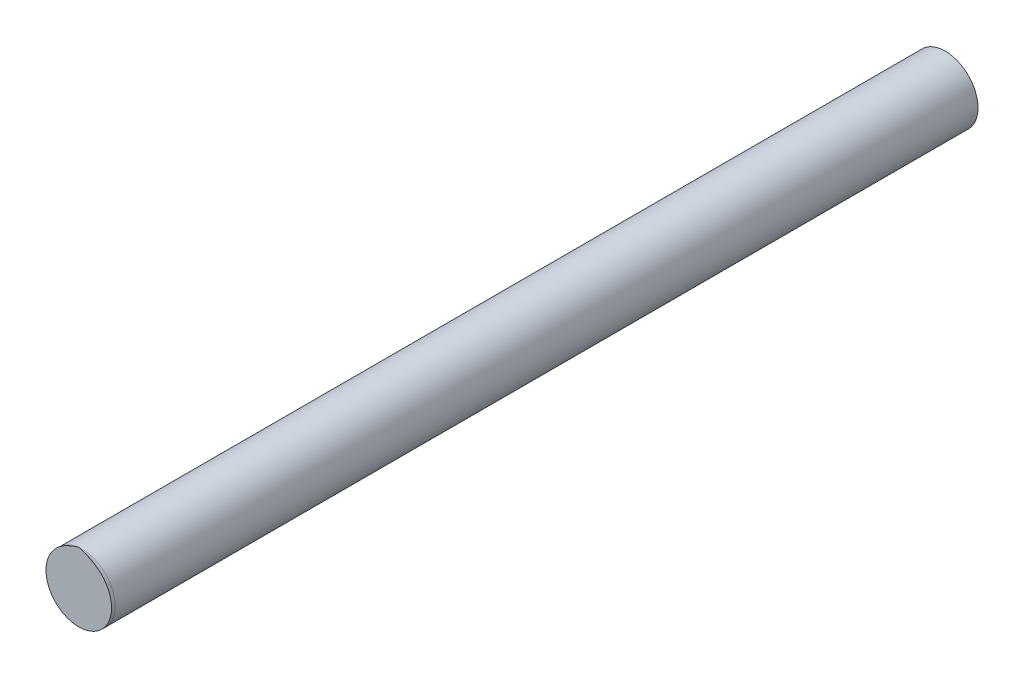
ISO-10303-21;
HEADER;
FILE_DESCRIPTION(('STEP AP214'),'2;1');
FILE_NAME('part.step','',(''),(''),'','','');
FILE_SCHEMA(('AUTOMOTIVE_DESIGN { 1 0 10303 214 1 1 1 1 }'));
ENDSEC;
DATA;
#1=APPLICATION_CONTEXT('core data for automotive mechanical design processes');
#2=APPLICATION_PROTOCOL_DEFINITION('international standard','automotive_design',2000,#1);
#3=PRODUCT_CONTEXT('',#1,'mechanical');
#4=PRODUCT('Part','Part','',(#3));
#5=PRODUCT_RELATED_PRODUCT_CATEGORY('part','',(#4));
#6=PRODUCT_DEFINITION_FORMATION('','',#4);
#7=PRODUCT_DEFINITION_CONTEXT('part definition',#1,'design');
#8=PRODUCT_DEFINITION('design','',#6,#7);
#9=PRODUCT_DEFINITION_SHAPE('','',#8);
#10=(LENGTH_UNIT() NAMED_UNIT(*) SI_UNIT(.MILLI.,.METRE.));
#11=(NAMED_UNIT(*) PLANE_ANGLE_UNIT() SI_UNIT($,.RADIAN.));
#12=(NAMED_UNIT(*) SI_UNIT($,.STERADIAN.) SOLID_ANGLE_UNIT());
#13=UNCERTAINTY_MEASURE_WITH_UNIT(LENGTH_MEASURE(1.E-05),#10,'distance_accuracy_value','');
#14=(GEOMETRIC_REPRESENTATION_CONTEXT(3) GLOBAL_UNCERTAINTY_ASSIGNED_CONTEXT((#13)) GLOBAL_UNIT_ASSIGNED_CONTEXT((#10,
#11,#12)) REPRESENTATION_CONTEXT('',''));
#15=CARTESIAN_POINT('',(0.,0.,0.));
#16=DIRECTION('',(0.,0.,1.));
#17=DIRECTION('',(1.,0.,0.));
#18=AXIS2_PLACEMENT_3D('',#15,#16,#17);
#19=CARTESIAN_POINT('',(0.0127,-2.2352,-7.3152));
#20=DIRECTION('',(0.,0.,-1.));
#21=DIRECTION('',(-1.,0.,0.));
#22=AXIS2_PLACEMENT_3D('',#19,#20,#21);
#23=PLANE('',#22);
#24=CARTESIAN_POINT('',(0.0127,-2.2352,-7.3152));
#25=DIRECTION('',(0.,0.,1.));
#26=DIRECTION('',(0.,1.,0.));
#27=AXIS2_PLACEMENT_3D('',#24,#25,#26);
#28=CIRCLE('',#27,0.2286);
#29=CARTESIAN_POINT('',(0.0127,-2.0066,-7.3152));
#30=VERTEX_POINT('',#29);
#31=EDGE_CURVE('E11',#30,#30,#28,.T.);
#32=ORIENTED_EDGE('',*,*,#31,.F.);
#33=EDGE_LOOP('',(#32));
#34=FACE_BOUND('',#33,.T.);
#35=ADVANCED_FACE('F16',(#34),#23,.T.);
#36=CARTESIAN_POINT('',(0.0127,-2.2352,-1.175004));
#37=DIRECTION('',(0.,0.,1.));
#38=DIRECTION('',(1.,0.,0.));
#39=AXIS2_PLACEMENT_3D('',#36,#37,#38);
#40=CYLINDRICAL_SURFACE('',#39,0.2286);
#41=CARTESIAN_POINT('',(0.0127,-2.2352,-1.2954));
#42=DIRECTION('',(0.,0.,1.));
#43=DIRECTION('',(0.,-1.,0.));
#44=AXIS2_PLACEMENT_3D('',#41,#42,#43);
#45=CIRCLE('',#44,0.2286);
#46=CARTESIAN_POINT('',(0.0127,-2.4638,-1.2954));
#47=VERTEX_POINT('',#46);
#48=EDGE_CURVE('E38',#47,#47,#45,.T.);
#49=ORIENTED_EDGE('',*,*,#48,.F.);
#50=EDGE_LOOP('',(#49));
#51=FACE_BOUND('',#50,.T.);
#52=ORIENTED_EDGE('',*,*,#31,.T.);
#53=EDGE_LOOP('',(#52));
#54=FACE_BOUND('',#53,.T.);
#55=ADVANCED_FACE('F50',(#51,#54),#40,.T.);
#56=CARTESIAN_POINT('',(0.0127007321094578,-2.22216555770495,-1.27));
#57=DIRECTION('',(0.,0.,1.));
#58=DIRECTION('',(1.,0.,0.));
#59=AXIS2_PLACEMENT_3D('',#56,#57,#58);
#60=PLANE('',#59);
#61=CARTESIAN_POINT('',(0.0127,-1.9812,-1.27));
#62=CARTESIAN_POINT('',(0.00268453589315014,-1.98453848803574,-1.27));
#63=CARTESIAN_POINT('',(-0.0162866236035965,-1.99088808571777,-1.27));
#64=CARTESIAN_POINT('',(-0.0410183642985658,-2.00010544064091,-1.27));
#65=CARTESIAN_POINT('',(-0.0628260454743532,-2.00952859681412,-1.27));
#66=CARTESIAN_POINT('',(-0.0822967720433124,-2.01937510670831,-1.27));
#67=CARTESIAN_POINT('',(-0.100120348057278,-2.02990548522079,-1.27));
#68=CARTESIAN_POINT('',(-0.116781937251762,-2.04137724442835,-1.27));
#69=CARTESIAN_POINT('',(-0.132839108016757,-2.0542710498886,-1.27));
#70=CARTESIAN_POINT('',(-0.148727420944944,-2.06927436297462,-1.27));
#71=CARTESIAN_POINT('',(-0.164657633850317,-2.08728470245323,-1.27));
#72=CARTESIAN_POINT('',(-0.180074245920841,-2.10888467021943,-1.27));
#73=CARTESIAN_POINT('',(-0.193409834516667,-2.13296199528795,-1.27));
#74=CARTESIAN_POINT('',(-0.20399202444907,-2.15885823902901,-1.27));
#75=CARTESIAN_POINT('',(-0.21135486840735,-2.18559786433274,-1.27));
#76=CARTESIAN_POINT('',(-0.215475021750085,-2.21281721006514,-1.27));
#77=CARTESIAN_POINT('',(-0.216357590024493,-2.24013488917084,-1.27));
#78=CARTESIAN_POINT('',(-0.213992962384416,-2.26747947960423,-1.27));
#79=CARTESIAN_POINT('',(-0.208443621429957,-2.2941736482257,-1.27));
#80=CARTESIAN_POINT('',(-0.199750601001047,-2.32009454117527,-1.27));
#81=CARTESIAN_POINT('',(-0.188110652602123,-2.34467419291224,-1.27));
#82=CARTESIAN_POINT('',(-0.17359153704661,-2.36778266122302,-1.27));
#83=CARTESIAN_POINT('',(-0.156513452433226,-2.38891157332503,-1.27));
#84=CARTESIAN_POINT('',(-0.13699193671822,-2.40792825804267,-1.27));
#85=CARTESIAN_POINT('',(-0.115432337377993,-2.42443574353411,-1.27));
#86=CARTESIAN_POINT('',(-0.0920081457145064,-2.43830942531348,-1.27));
#87=CARTESIAN_POINT('',(-0.067168246100247,-2.44927753579124,-1.27));
#88=CARTESIAN_POINT('',(-0.0411654466827596,-2.45724046701267,-1.27));
#89=CARTESIAN_POINT('',(-0.0144106131406973,-2.46205434577351,-1.27));
#90=CARTESIAN_POINT('',(0.00361434144617438,-2.46313111540965,-1.27));
#91=CARTESIAN_POINT('',(0.0127,-2.46313111540965,-1.27));
#92=B_SPLINE_CURVE_WITH_KNOTS('',3,(#61,#62,#63,#64,#65,#66,#67,#68,#69,#70,#71,#72,#73,#74,#75,
#76,#77,#78,#79,#80,#81,#82,#83,#84,#85,#86,#87,#88,#89,#90,#91),.UNSPECIFIED.,.F.,.F.,(4,1,1,1,
1,1,1,1,1,1,1,1,1,1,1,1,1,1,1,1,1,1,1,1,1,1,1,1,4),(0.,0.03571428571429,0.07142857142857,
0.1071428571429,0.1428571428571,0.1785714285714,0.2142857142857,0.25,0.2857142857143,
0.3214285714286,0.3571428571429,0.3928571428571,0.4285714285714,0.4642857142857,0.5,
0.5357142857143,0.5714285714286,0.6071428571429,0.6428571428571,0.6785714285714,0.7142857142857,
0.75,0.7857142857143,0.8214285714286,0.8571428571429,0.8928571428571,0.9285714285714,
0.9642857142857,1.),.UNSPECIFIED.);
#93=CARTESIAN_POINT('',(0.0127,-1.9812,-1.27));
#94=VERTEX_POINT('',#93);
#95=CARTESIAN_POINT('',(0.0127,-2.46313111540965,-1.27));
#96=VERTEX_POINT('',#95);
#97=EDGE_CURVE('E29',#94,#96,#92,.T.);
#98=ORIENTED_EDGE('',*,*,#97,.T.);
#99=CARTESIAN_POINT('',(0.0127,-1.9812,-1.27));
#100=CARTESIAN_POINT('',(0.0228227855411093,-1.98457426184709,-1.27));
#101=CARTESIAN_POINT('',(0.0419732407383392,-1.99098489890362,-1.27));
#102=CARTESIAN_POINT('',(0.0668594976546514,-2.00027912066515,-1.27));
#103=CARTESIAN_POINT('',(0.088718251439825,-2.00975716922642,-1.27));
#104=CARTESIAN_POINT('',(0.108185495115445,-2.01964304198981,-1.27));
#105=CARTESIAN_POINT('',(0.125897486815877,-2.03015124521873,-1.27));
#106=CARTESIAN_POINT('',(0.14237132454779,-2.04152383144074,-1.27));
#107=CARTESIAN_POINT('',(0.158301038449385,-2.05433092471322,-1.27));
#108=CARTESIAN_POINT('',(0.174148102948894,-2.06928822834186,-1.27));
#109=CARTESIAN_POINT('',(0.190215050040158,-2.08748289030806,-1.27));
#110=CARTESIAN_POINT('',(0.205476916571659,-2.10890311435856,-1.27));
#111=CARTESIAN_POINT('',(0.218845003461188,-2.13301324644224,-1.27));
#112=CARTESIAN_POINT('',(0.2295035238946,-2.15916734320583,-1.27));
#113=CARTESIAN_POINT('',(0.236813676595601,-2.1858981076558,-1.27));
#114=CARTESIAN_POINT('',(0.240891682964108,-2.21301932205436,-1.27));
#115=CARTESIAN_POINT('',(0.241752080196955,-2.24034241673801,-1.27));
#116=CARTESIAN_POINT('',(0.239364910654896,-2.26766884265858,-1.27));
#117=CARTESIAN_POINT('',(0.233791695911203,-2.29436209366719,-1.27));
#118=CARTESIAN_POINT('',(0.225092007512316,-2.32023779240718,-1.27));
#119=CARTESIAN_POINT('',(0.213434625043231,-2.34481129696137,-1.27));
#120=CARTESIAN_POINT('',(0.198921412840046,-2.367879735307,-1.27));
#121=CARTESIAN_POINT('',(0.181828505387093,-2.38900368860511,-1.27));
#122=CARTESIAN_POINT('',(0.16232731027808,-2.40798311839751,-1.27));
#123=CARTESIAN_POINT('',(0.140758068646647,-2.42448516383151,-1.27));
#124=CARTESIAN_POINT('',(0.117362136111606,-2.43833220271649,-1.27));
#125=CARTESIAN_POINT('',(0.0925176233562552,-2.44929593096908,-1.27));
#126=CARTESIAN_POINT('',(0.0665430303986108,-2.45724496480707,-1.27));
#127=CARTESIAN_POINT('',(0.0397926285827066,-2.4620562840757,-1.27));
#128=CARTESIAN_POINT('',(0.021779552573048,-2.46313111540965,-1.27));
#129=CARTESIAN_POINT('',(0.0127,-2.46313111540965,-1.27));
#130=B_SPLINE_CURVE_WITH_KNOTS('',3,(#99,#100,#101,#102,#103,#104,#105,#106,#107,#108,#109,#110,
#111,#112,#113,#114,#115,#116,#117,#118,#119,#120,#121,#122,#123,#124,#125,#126,#127,#128,#129),
.UNSPECIFIED.,.F.,.F.,(4,1,1,1,1,1,1,1,1,1,1,1,1,1,1,1,1,1,1,1,1,1,1,1,1,1,1,1,4),(0.,
0.03571428571429,0.07142857142857,0.1071428571429,0.1428571428571,0.1785714285714,
0.2142857142857,0.25,0.2857142857143,0.3214285714286,0.3571428571429,0.3928571428571,
0.4285714285714,0.4642857142857,0.5,0.5357142857143,0.5714285714286,0.6071428571429,
0.6428571428571,0.6785714285714,0.7142857142857,0.75,0.7857142857143,0.8214285714286,
0.8571428571429,0.8928571428571,0.9285714285714,0.9642857142857,1.),.UNSPECIFIED.);
#131=EDGE_CURVE('E21',#94,#96,#130,.T.);
#132=ORIENTED_EDGE('',*,*,#131,.F.);
#133=EDGE_LOOP('',(#98,#132));
#134=FACE_BOUND('',#133,.T.);
#135=ADVANCED_FACE('F37',(#134),#60,.T.);
#136=CARTESIAN_POINT('',(0.0127,-1.9812,-1.2954));
#137=DIRECTION('',(1.,0.,0.));
#138=DIRECTION('',(0.,0.,-1.));
#139=AXIS2_PLACEMENT_3D('',#136,#137,#138);
#140=TOROIDAL_SURFACE('',#139,0.253999999999949,0.228599999999975);
#141=ORIENTED_EDGE('',*,*,#97,.F.);
#142=ORIENTED_EDGE('',*,*,#131,.T.);
#143=EDGE_LOOP('',(#141,#142));
#144=FACE_BOUND('',#143,.T.);
#145=ORIENTED_EDGE('',*,*,#48,.T.);
#146=EDGE_LOOP('',(#145));
#147=FACE_BOUND('',#146,.T.);
#148=ADVANCED_FACE('F18',(#144,#147),#140,.T.);
#149=CLOSED_SHELL('',(#35,#55,#135,#148));
#150=MANIFOLD_SOLID_BREP('B1',#149);
#151=ADVANCED_BREP_SHAPE_REPRESENTATION('',(#18,#150),#14);
#152=SHAPE_DEFINITION_REPRESENTATION(#9,#151);
ENDSEC;
END-ISO-10303-21;
